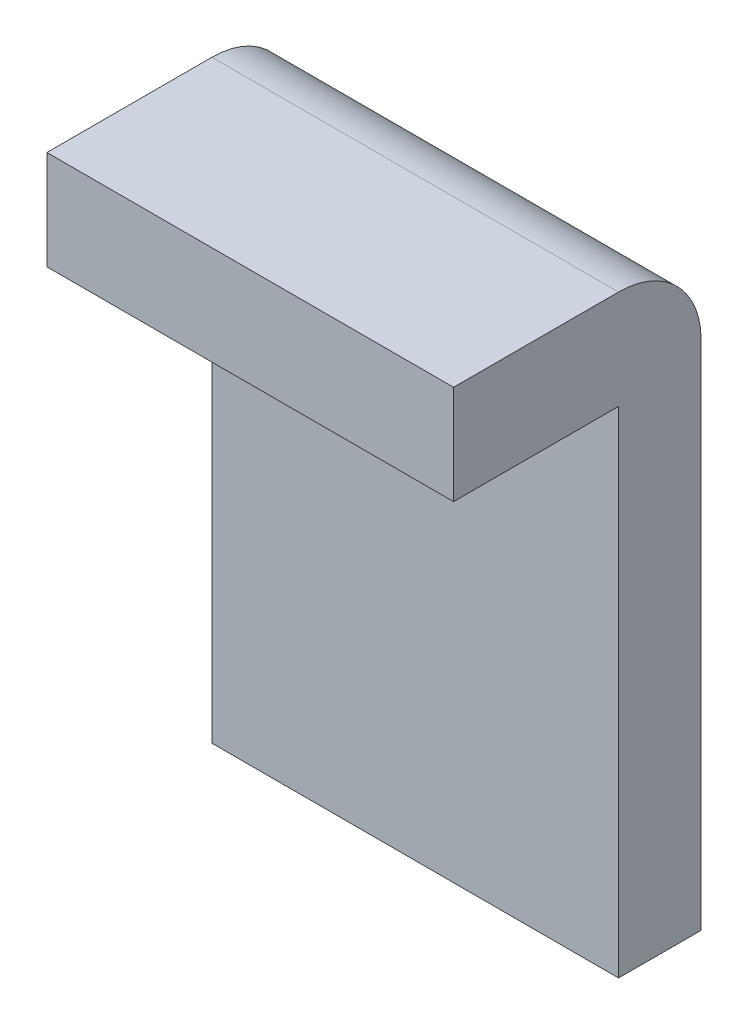
ISO-10303-21;
HEADER;
FILE_DESCRIPTION(('STEP AP214'),'2;1');
FILE_NAME('part.step','',(''),(''),'','','');
FILE_SCHEMA(('AUTOMOTIVE_DESIGN { 1 0 10303 214 1 1 1 1 }'));
ENDSEC;
DATA;
#1=APPLICATION_CONTEXT('core data for automotive mechanical design processes');
#2=APPLICATION_PROTOCOL_DEFINITION('international standard','automotive_design',2000,#1);
#3=PRODUCT_CONTEXT('',#1,'mechanical');
#4=PRODUCT('Part','Part','',(#3));
#5=PRODUCT_RELATED_PRODUCT_CATEGORY('part','',(#4));
#6=PRODUCT_DEFINITION_FORMATION('','',#4);
#7=PRODUCT_DEFINITION_CONTEXT('part definition',#1,'design');
#8=PRODUCT_DEFINITION('design','',#6,#7);
#9=PRODUCT_DEFINITION_SHAPE('','',#8);
#10=(LENGTH_UNIT() NAMED_UNIT(*) SI_UNIT(.MILLI.,.METRE.));
#11=(NAMED_UNIT(*) PLANE_ANGLE_UNIT() SI_UNIT($,.RADIAN.));
#12=(NAMED_UNIT(*) SI_UNIT($,.STERADIAN.) SOLID_ANGLE_UNIT());
#13=UNCERTAINTY_MEASURE_WITH_UNIT(LENGTH_MEASURE(1.E-05),#10,'distance_accuracy_value','');
#14=(GEOMETRIC_REPRESENTATION_CONTEXT(3) GLOBAL_UNCERTAINTY_ASSIGNED_CONTEXT((#13)) GLOBAL_UNIT_ASSIGNED_CONTEXT((#10,
#11,#12)) REPRESENTATION_CONTEXT('',''));
#15=CARTESIAN_POINT('',(0.,0.,0.));
#16=DIRECTION('',(0.,0.,1.));
#17=DIRECTION('',(1.,0.,0.));
#18=AXIS2_PLACEMENT_3D('',#15,#16,#17);
#19=CARTESIAN_POINT('',(-8.34906661620967,8.30000000000001,4.25467377707551));
#20=DIRECTION('',(0.,1.,0.));
#21=DIRECTION('',(0.,0.,1.));
#22=AXIS2_PLACEMENT_3D('',#19,#20,#21);
#23=PLANE('',#22);
#24=DIRECTION('',(1.,0.,0.));
#25=VECTOR('',#24,1.);
#26=CARTESIAN_POINT('',(-0.8725217929937,8.30000000000001,4.25467377707552));
#27=LINE('',#26,#25);
#28=CARTESIAN_POINT('',(-0.8725217929937,8.30000000000001,4.25467377707551));
#29=VERTEX_POINT('',#28);
#30=CARTESIAN_POINT('',(0.359628963447023,8.30000000000001,4.25467377707551));
#31=VERTEX_POINT('',#30);
#32=EDGE_CURVE('E133',#29,#31,#27,.T.);
#33=ORIENTED_EDGE('',*,*,#32,.F.);
#34=DIRECTION('',(0.,0.,1.));
#35=VECTOR('',#34,1.);
#36=CARTESIAN_POINT('',(-0.8725217929937,8.30000000000001,4.25467377707553));
#37=LINE('',#36,#35);
#38=CARTESIAN_POINT('',(-0.8725217929937,8.30000000000001,3.75467377707551));
#39=VERTEX_POINT('',#38);
#40=EDGE_CURVE('E113',#39,#29,#37,.T.);
#41=ORIENTED_EDGE('',*,*,#40,.F.);
#42=DIRECTION('',(1.,0.,0.));
#43=VECTOR('',#42,1.);
#44=CARTESIAN_POINT('',(-8.34906661620967,8.30000000000001,3.75467377707551));
#45=LINE('',#44,#43);
#46=CARTESIAN_POINT('',(0.359628963447023,8.30000000000001,3.75467377707551));
#47=VERTEX_POINT('',#46);
#48=EDGE_CURVE('E130',#39,#47,#45,.T.);
#49=ORIENTED_EDGE('',*,*,#48,.T.);
#50=DIRECTION('',(0.,0.,-1.));
#51=VECTOR('',#50,1.);
#52=CARTESIAN_POINT('',(0.359628963447024,8.30000000000001,4.25467377707553));
#53=LINE('',#52,#51);
#54=EDGE_CURVE('E129',#31,#47,#53,.T.);
#55=ORIENTED_EDGE('',*,*,#54,.F.);
#56=EDGE_LOOP('',(#33,#41,#49,#55));
#57=FACE_BOUND('',#56,.T.);
#58=ADVANCED_FACE('F17',(#57),#23,.F.);
#59=CARTESIAN_POINT('',(-0.8725217929937,5.35753839337144,4.25467377707553));
#60=DIRECTION('',(0.,0.,1.));
#61=DIRECTION('',(0.,-1.,0.));
#62=AXIS2_PLACEMENT_3D('',#59,#60,#61);
#63=PLANE('',#62);
#64=DIRECTION('',(1.,0.,0.));
#65=VECTOR('',#64,1.);
#66=CARTESIAN_POINT('',(-8.34906661620967,8.6,4.25467377707551));
#67=LINE('',#66,#65);
#68=CARTESIAN_POINT('',(0.359628963447023,8.6,4.25467377707551));
#69=VERTEX_POINT('',#68);
#70=CARTESIAN_POINT('',(-0.8725217929937,8.6,4.25467377707551));
#71=VERTEX_POINT('',#70);
#72=EDGE_CURVE('E131',#69,#71,#67,.F.);
#73=ORIENTED_EDGE('',*,*,#72,.T.);
#74=DIRECTION('',(0.,1.,0.));
#75=VECTOR('',#74,1.);
#76=CARTESIAN_POINT('',(-0.8725217929937,5.35753839337144,4.25467377707551));
#77=LINE('',#76,#75);
#78=EDGE_CURVE('E136',#29,#71,#77,.T.);
#79=ORIENTED_EDGE('',*,*,#78,.F.);
#80=ORIENTED_EDGE('',*,*,#32,.T.);
#81=DIRECTION('',(0.,1.,0.));
#82=VECTOR('',#81,1.);
#83=CARTESIAN_POINT('',(0.359628963447024,5.35753839337144,4.25467377707551));
#84=LINE('',#83,#82);
#85=EDGE_CURVE('E120',#69,#31,#84,.F.);
#86=ORIENTED_EDGE('',*,*,#85,.F.);
#87=EDGE_LOOP('',(#73,#79,#80,#86));
#88=FACE_BOUND('',#87,.T.);
#89=ADVANCED_FACE('F172',(#88),#63,.T.);
#90=CARTESIAN_POINT('',(-8.34906661620967,8.6,4.25467377707551));
#91=DIRECTION('',(0.,-1.,0.));
#92=DIRECTION('',(0.,0.,-1.));
#93=AXIS2_PLACEMENT_3D('',#90,#91,#92);
#94=PLANE('',#93);
#95=DIRECTION('',(1.,0.,0.));
#96=VECTOR('',#95,1.);
#97=CARTESIAN_POINT('',(-8.34906661620967,8.6,3.75467377707551));
#98=LINE('',#97,#96);
#99=CARTESIAN_POINT('',(-0.872521792993701,8.6,3.7546737770755));
#100=VERTEX_POINT('',#99);
#101=CARTESIAN_POINT('',(0.359628963447023,8.6,3.7546737770755));
#102=VERTEX_POINT('',#101);
#103=EDGE_CURVE('E79',#100,#102,#98,.T.);
#104=ORIENTED_EDGE('',*,*,#103,.F.);
#105=DIRECTION('',(0.,0.,1.));
#106=VECTOR('',#105,1.);
#107=CARTESIAN_POINT('',(-0.8725217929937,8.6,4.25467377707553));
#108=LINE('',#107,#106);
#109=EDGE_CURVE('E139',#71,#100,#108,.F.);
#110=ORIENTED_EDGE('',*,*,#109,.F.);
#111=ORIENTED_EDGE('',*,*,#72,.F.);
#112=DIRECTION('',(0.,0.,-1.));
#113=VECTOR('',#112,1.);
#114=CARTESIAN_POINT('',(0.359628963447024,8.6,4.25467377707553));
#115=LINE('',#114,#113);
#116=EDGE_CURVE('E83',#102,#69,#115,.F.);
#117=ORIENTED_EDGE('',*,*,#116,.F.);
#118=EDGE_LOOP('',(#104,#110,#111,#117));
#119=FACE_BOUND('',#118,.T.);
#120=ADVANCED_FACE('F169',(#119),#94,.F.);
#121=CARTESIAN_POINT('',(-8.34906661620967,8.30000000000001,3.75467377707551));
#122=DIRECTION('',(0.,0.,-1.));
#123=DIRECTION('',(0.,1.,0.));
#124=AXIS2_PLACEMENT_3D('',#121,#122,#123);
#125=PLANE('',#124);
#126=ORIENTED_EDGE('',*,*,#48,.F.);
#127=DIRECTION('',(0.,1.,0.));
#128=VECTOR('',#127,1.);
#129=CARTESIAN_POINT('',(-0.8725217929937,5.35753839337144,3.75467377707551));
#130=LINE('',#129,#128);
#131=CARTESIAN_POINT('',(-0.8725217929937,6.8,3.75467377707551));
#132=VERTEX_POINT('',#131);
#133=EDGE_CURVE('E95',#132,#39,#130,.T.);
#134=ORIENTED_EDGE('',*,*,#133,.F.);
#135=DIRECTION('',(1.,0.,0.));
#136=VECTOR('',#135,1.);
#137=CARTESIAN_POINT('',(-15.8147962412963,6.8,3.75467377707551));
#138=LINE('',#137,#136);
#139=CARTESIAN_POINT('',(0.359628963447024,6.8,3.75467377707551));
#140=VERTEX_POINT('',#139);
#141=EDGE_CURVE('E114',#140,#132,#138,.F.);
#142=ORIENTED_EDGE('',*,*,#141,.F.);
#143=DIRECTION('',(0.,1.,0.));
#144=VECTOR('',#143,1.);
#145=CARTESIAN_POINT('',(0.359628963447024,5.35753839337144,3.75467377707551));
#146=LINE('',#145,#144);
#147=EDGE_CURVE('E84',#47,#140,#146,.F.);
#148=ORIENTED_EDGE('',*,*,#147,.F.);
#149=EDGE_LOOP('',(#126,#134,#142,#148));
#150=FACE_BOUND('',#149,.T.);
#151=ADVANCED_FACE('F178',(#150),#125,.F.);
#152=CARTESIAN_POINT('',(-8.34906661620967,8.35,3.7546737770755));
#153=DIRECTION('',(1.,0.,0.));
#154=DIRECTION('',(0.,0.,-1.));
#155=AXIS2_PLACEMENT_3D('',#152,#153,#154);
#156=CYLINDRICAL_SURFACE('',#155,0.249999999999996);
#157=CARTESIAN_POINT('',(-0.872521792993701,8.35,3.7546737770755));
#158=DIRECTION('',(1.,0.,0.));
#159=DIRECTION('',(0.,0.,-1.));
#160=AXIS2_PLACEMENT_3D('',#157,#158,#159);
#161=CIRCLE('',#160,0.249999999999996);
#162=CARTESIAN_POINT('',(-0.8725217929937,8.35,3.50467377707551));
#163=VERTEX_POINT('',#162);
#164=EDGE_CURVE('E106',#100,#163,#161,.F.);
#165=ORIENTED_EDGE('',*,*,#164,.F.);
#166=ORIENTED_EDGE('',*,*,#103,.T.);
#167=CARTESIAN_POINT('',(0.359628963447021,8.35,3.7546737770755));
#168=DIRECTION('',(1.,0.,0.));
#169=DIRECTION('',(0.,0.,-1.));
#170=AXIS2_PLACEMENT_3D('',#167,#168,#169);
#171=CIRCLE('',#170,0.249999999999996);
#172=CARTESIAN_POINT('',(0.359628963447019,8.35,3.50467377707551));
#173=VERTEX_POINT('',#172);
#174=EDGE_CURVE('E20',#173,#102,#171,.T.);
#175=ORIENTED_EDGE('',*,*,#174,.F.);
#176=DIRECTION('',(1.,0.,0.));
#177=VECTOR('',#176,1.);
#178=CARTESIAN_POINT('',(-0.8725217929937,8.35,3.50467377707551));
#179=LINE('',#178,#177);
#180=EDGE_CURVE('E77',#163,#173,#179,.T.);
#181=ORIENTED_EDGE('',*,*,#180,.F.);
#182=EDGE_LOOP('',(#165,#166,#175,#181));
#183=FACE_BOUND('',#182,.T.);
#184=ADVANCED_FACE('F75',(#183),#156,.T.);
#185=CARTESIAN_POINT('',(0.359628963447024,5.35753839337144,4.25467377707553));
#186=DIRECTION('',(1.,0.,0.));
#187=DIRECTION('',(0.,0.,-1.));
#188=AXIS2_PLACEMENT_3D('',#185,#186,#187);
#189=PLANE('',#188);
#190=ORIENTED_EDGE('',*,*,#116,.T.);
#191=ORIENTED_EDGE('',*,*,#85,.T.);
#192=ORIENTED_EDGE('',*,*,#54,.T.);
#193=ORIENTED_EDGE('',*,*,#147,.T.);
#194=DIRECTION('',(0.,0.,-1.));
#195=VECTOR('',#194,1.);
#196=CARTESIAN_POINT('',(0.359628963447024,6.80000000000003,12.5046737770755));
#197=LINE('',#196,#195);
#198=CARTESIAN_POINT('',(0.35962896344702,6.8,3.50467377707552));
#199=VERTEX_POINT('',#198);
#200=EDGE_CURVE('E90',#199,#140,#197,.F.);
#201=ORIENTED_EDGE('',*,*,#200,.F.);
#202=DIRECTION('',(0.,1.,0.));
#203=VECTOR('',#202,1.);
#204=CARTESIAN_POINT('',(0.359628963447017,5.35753839337143,3.50467377707553));
#205=LINE('',#204,#203);
#206=EDGE_CURVE('E86',#173,#199,#205,.F.);
#207=ORIENTED_EDGE('',*,*,#206,.F.);
#208=ORIENTED_EDGE('',*,*,#174,.T.);
#209=EDGE_LOOP('',(#190,#191,#192,#193,#201,#207,#208));
#210=FACE_BOUND('',#209,.T.);
#211=ADVANCED_FACE('F87',(#210),#189,.T.);
#212=CARTESIAN_POINT('',(-15.8147962412963,6.80000000000003,12.5046737770755));
#213=DIRECTION('',(0.,-1.,0.));
#214=DIRECTION('',(0.,0.,-1.));
#215=AXIS2_PLACEMENT_3D('',#212,#213,#214);
#216=PLANE('',#215);
#217=DIRECTION('',(1.,0.,0.));
#218=VECTOR('',#217,1.);
#219=CARTESIAN_POINT('',(-0.8725217929937,6.8,3.50467377707552));
#220=LINE('',#219,#218);
#221=CARTESIAN_POINT('',(-0.8725217929937,6.8,3.50467377707552));
#222=VERTEX_POINT('',#221);
#223=EDGE_CURVE('E26',#199,#222,#220,.F.);
#224=ORIENTED_EDGE('',*,*,#223,.F.);
#225=ORIENTED_EDGE('',*,*,#200,.T.);
#226=ORIENTED_EDGE('',*,*,#141,.T.);
#227=DIRECTION('',(0.,0.,1.));
#228=VECTOR('',#227,1.);
#229=CARTESIAN_POINT('',(-0.8725217929937,6.8,4.25467377707553));
#230=LINE('',#229,#228);
#231=EDGE_CURVE('E35',#222,#132,#230,.T.);
#232=ORIENTED_EDGE('',*,*,#231,.F.);
#233=EDGE_LOOP('',(#224,#225,#226,#232));
#234=FACE_BOUND('',#233,.T.);
#235=ADVANCED_FACE('F179',(#234),#216,.T.);
#236=CARTESIAN_POINT('',(-0.8725217929937,5.35753839337144,4.25467377707553));
#237=DIRECTION('',(-1.,0.,0.));
#238=DIRECTION('',(0.,0.,1.));
#239=AXIS2_PLACEMENT_3D('',#236,#237,#238);
#240=PLANE('',#239);
#241=ORIENTED_EDGE('',*,*,#231,.T.);
#242=ORIENTED_EDGE('',*,*,#133,.T.);
#243=ORIENTED_EDGE('',*,*,#40,.T.);
#244=ORIENTED_EDGE('',*,*,#78,.T.);
#245=ORIENTED_EDGE('',*,*,#109,.T.);
#246=ORIENTED_EDGE('',*,*,#164,.T.);
#247=DIRECTION('',(0.,1.,0.));
#248=VECTOR('',#247,1.);
#249=CARTESIAN_POINT('',(-0.8725217929937,5.35753839337143,3.50467377707553));
#250=LINE('',#249,#248);
#251=EDGE_CURVE('E11',#222,#163,#250,.T.);
#252=ORIENTED_EDGE('',*,*,#251,.F.);
#253=EDGE_LOOP('',(#241,#242,#243,#244,#245,#246,#252));
#254=FACE_BOUND('',#253,.T.);
#255=ADVANCED_FACE('F166',(#254),#240,.T.);
#256=CARTESIAN_POINT('',(-0.8725217929937,5.35753839337143,3.50467377707553));
#257=DIRECTION('',(0.,0.,-1.));
#258=DIRECTION('',(0.,1.,0.));
#259=AXIS2_PLACEMENT_3D('',#256,#257,#258);
#260=PLANE('',#259);
#261=ORIENTED_EDGE('',*,*,#223,.T.);
#262=ORIENTED_EDGE('',*,*,#251,.T.);
#263=ORIENTED_EDGE('',*,*,#180,.T.);
#264=ORIENTED_EDGE('',*,*,#206,.T.);
#265=EDGE_LOOP('',(#261,#262,#263,#264));
#266=FACE_BOUND('',#265,.T.);
#267=ADVANCED_FACE('F94',(#266),#260,.T.);
#268=CLOSED_SHELL('',(#58,#89,#120,#151,#184,#211,#235,#255,#267));
#269=MANIFOLD_SOLID_BREP('B1',#268);
#270=ADVANCED_BREP_SHAPE_REPRESENTATION('',(#18,#269),#14);
#271=SHAPE_DEFINITION_REPRESENTATION(#9,#270);
ENDSEC;
END-ISO-10303-21;
